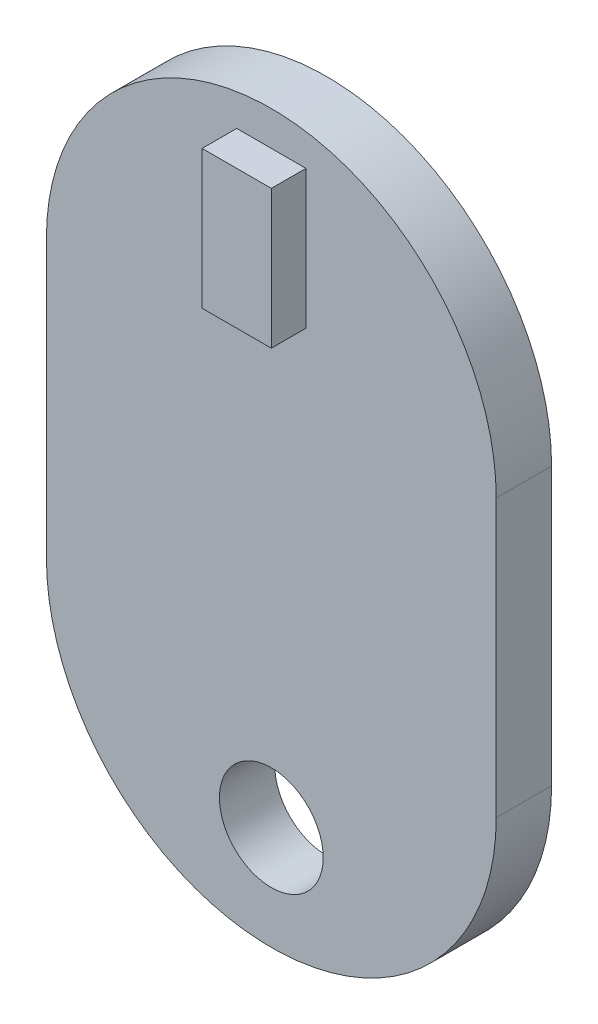
ISO-10303-21;
HEADER;
FILE_DESCRIPTION(('STEP AP214'),'2;1');
FILE_NAME('part.step','',(''),(''),'','','');
FILE_SCHEMA(('AUTOMOTIVE_DESIGN { 1 0 10303 214 1 1 1 1 }'));
ENDSEC;
DATA;
#1=APPLICATION_CONTEXT('core data for automotive mechanical design processes');
#2=APPLICATION_PROTOCOL_DEFINITION('international standard','automotive_design',2000,#1);
#3=PRODUCT_CONTEXT('',#1,'mechanical');
#4=PRODUCT('Part','Part','',(#3));
#5=PRODUCT_RELATED_PRODUCT_CATEGORY('part','',(#4));
#6=PRODUCT_DEFINITION_FORMATION('','',#4);
#7=PRODUCT_DEFINITION_CONTEXT('part definition',#1,'design');
#8=PRODUCT_DEFINITION('design','',#6,#7);
#9=PRODUCT_DEFINITION_SHAPE('','',#8);
#10=(LENGTH_UNIT() NAMED_UNIT(*) SI_UNIT(.MILLI.,.METRE.));
#11=(NAMED_UNIT(*) PLANE_ANGLE_UNIT() SI_UNIT($,.RADIAN.));
#12=(NAMED_UNIT(*) SI_UNIT($,.STERADIAN.) SOLID_ANGLE_UNIT());
#13=UNCERTAINTY_MEASURE_WITH_UNIT(LENGTH_MEASURE(1.E-05),#10,'distance_accuracy_value','');
#14=(GEOMETRIC_REPRESENTATION_CONTEXT(3) GLOBAL_UNCERTAINTY_ASSIGNED_CONTEXT((#13)) GLOBAL_UNIT_ASSIGNED_CONTEXT((#10,
#11,#12)) REPRESENTATION_CONTEXT('',''));
#15=CARTESIAN_POINT('',(0.,0.,0.));
#16=DIRECTION('',(0.,0.,1.));
#17=DIRECTION('',(1.,0.,0.));
#18=AXIS2_PLACEMENT_3D('',#15,#16,#17);
#19=CARTESIAN_POINT('',(0.,-3.5,1.6));
#20=DIRECTION('',(0.,0.,1.));
#21=DIRECTION('',(1.,0.,0.));
#22=AXIS2_PLACEMENT_3D('',#19,#20,#21);
#23=PLANE('',#22);
#24=CARTESIAN_POINT('',(0.,-3.5,1.6));
#25=DIRECTION('',(0.,0.,1.));
#26=DIRECTION('',(1.,0.,0.));
#27=AXIS2_PLACEMENT_3D('',#24,#25,#26);
#28=CIRCLE('',#27,6.5);
#29=CARTESIAN_POINT('',(6.5,-3.5,1.6));
#30=VERTEX_POINT('',#29);
#31=CARTESIAN_POINT('',(-6.5,-3.5,1.6));
#32=VERTEX_POINT('',#31);
#33=EDGE_CURVE('E143',#30,#32,#28,.T.);
#34=ORIENTED_EDGE('',*,*,#33,.T.);
#35=DIRECTION('',(0.,-1.,0.));
#36=VECTOR('',#35,1.);
#37=CARTESIAN_POINT('',(-6.5,-3.5,1.6));
#38=LINE('',#37,#36);
#39=CARTESIAN_POINT('',(-6.5,-11.5,1.6));
#40=VERTEX_POINT('',#39);
#41=EDGE_CURVE('E85',#32,#40,#38,.T.);
#42=ORIENTED_EDGE('',*,*,#41,.T.);
#43=CARTESIAN_POINT('',(0.,-11.5,1.6));
#44=DIRECTION('',(0.,0.,1.));
#45=DIRECTION('',(1.,0.,0.));
#46=AXIS2_PLACEMENT_3D('',#43,#44,#45);
#47=CIRCLE('',#46,6.5);
#48=CARTESIAN_POINT('',(6.5,-11.5,1.6));
#49=VERTEX_POINT('',#48);
#50=EDGE_CURVE('E146',#40,#49,#47,.T.);
#51=ORIENTED_EDGE('',*,*,#50,.T.);
#52=DIRECTION('',(0.,1.,0.));
#53=VECTOR('',#52,1.);
#54=CARTESIAN_POINT('',(6.5,-3.5,1.6));
#55=LINE('',#54,#53);
#56=EDGE_CURVE('E57',#49,#30,#55,.T.);
#57=ORIENTED_EDGE('',*,*,#56,.T.);
#58=EDGE_LOOP('',(#34,#42,#51,#57));
#59=FACE_BOUND('',#58,.T.);
#60=CARTESIAN_POINT('',(0.,-15.,1.6));
#61=DIRECTION('',(0.,0.,1.));
#62=DIRECTION('',(1.,0.,0.));
#63=AXIS2_PLACEMENT_3D('',#60,#61,#62);
#64=CIRCLE('',#63,1.5);
#65=CARTESIAN_POINT('',(1.5,-15.,1.6));
#66=VERTEX_POINT('',#65);
#67=EDGE_CURVE('E135',#66,#66,#64,.T.);
#68=ORIENTED_EDGE('',*,*,#67,.F.);
#69=EDGE_LOOP('',(#68));
#70=FACE_BOUND('',#69,.T.);
#71=DIRECTION('',(1.,0.,0.));
#72=VECTOR('',#71,1.);
#73=CARTESIAN_POINT('',(-0.999999999999999,-2.,1.6));
#74=LINE('',#73,#72);
#75=CARTESIAN_POINT('',(-0.999999999999999,-2.,1.6));
#76=VERTEX_POINT('',#75);
#77=CARTESIAN_POINT('',(1.,-2.,1.6));
#78=VERTEX_POINT('',#77);
#79=EDGE_CURVE('E281',#76,#78,#74,.T.);
#80=ORIENTED_EDGE('',*,*,#79,.F.);
#81=DIRECTION('',(0.,-1.,0.));
#82=VECTOR('',#81,1.);
#83=CARTESIAN_POINT('',(-1.,2.,1.6));
#84=LINE('',#83,#82);
#85=CARTESIAN_POINT('',(-1.,2.,1.6));
#86=VERTEX_POINT('',#85);
#87=EDGE_CURVE('E130',#86,#76,#84,.T.);
#88=ORIENTED_EDGE('',*,*,#87,.F.);
#89=DIRECTION('',(-1.,0.,0.));
#90=VECTOR('',#89,1.);
#91=CARTESIAN_POINT('',(-1.,2.,1.6));
#92=LINE('',#91,#90);
#93=CARTESIAN_POINT('',(1.,2.,1.6));
#94=VERTEX_POINT('',#93);
#95=EDGE_CURVE('E126',#94,#86,#92,.T.);
#96=ORIENTED_EDGE('',*,*,#95,.F.);
#97=DIRECTION('',(0.,1.,0.));
#98=VECTOR('',#97,1.);
#99=CARTESIAN_POINT('',(1.,2.,1.6));
#100=LINE('',#99,#98);
#101=EDGE_CURVE('E278',#78,#94,#100,.T.);
#102=ORIENTED_EDGE('',*,*,#101,.F.);
#103=EDGE_LOOP('',(#80,#88,#96,#102));
#104=FACE_BOUND('',#103,.T.);
#105=ADVANCED_FACE('F33',(#59,#70,#104),#23,.T.);
#106=CARTESIAN_POINT('',(0.,-3.5,0.));
#107=DIRECTION('',(0.,0.,1.));
#108=DIRECTION('',(1.,0.,0.));
#109=AXIS2_PLACEMENT_3D('',#106,#107,#108);
#110=PLANE('',#109);
#111=CARTESIAN_POINT('',(0.,-3.5,0.));
#112=DIRECTION('',(0.,0.,1.));
#113=DIRECTION('',(1.,0.,0.));
#114=AXIS2_PLACEMENT_3D('',#111,#112,#113);
#115=CIRCLE('',#114,6.5);
#116=CARTESIAN_POINT('',(6.5,-3.5,0.));
#117=VERTEX_POINT('',#116);
#118=CARTESIAN_POINT('',(-6.5,-3.5,0.));
#119=VERTEX_POINT('',#118);
#120=EDGE_CURVE('E141',#117,#119,#115,.T.);
#121=ORIENTED_EDGE('',*,*,#120,.F.);
#122=DIRECTION('',(0.,1.,0.));
#123=VECTOR('',#122,1.);
#124=CARTESIAN_POINT('',(6.5,-3.5,0.));
#125=LINE('',#124,#123);
#126=CARTESIAN_POINT('',(6.5,-11.5,0.));
#127=VERTEX_POINT('',#126);
#128=EDGE_CURVE('E78',#127,#117,#125,.T.);
#129=ORIENTED_EDGE('',*,*,#128,.F.);
#130=CARTESIAN_POINT('',(0.,-11.5,0.));
#131=DIRECTION('',(0.,0.,1.));
#132=DIRECTION('',(1.,0.,0.));
#133=AXIS2_PLACEMENT_3D('',#130,#131,#132);
#134=CIRCLE('',#133,6.5);
#135=CARTESIAN_POINT('',(-6.5,-11.5,0.));
#136=VERTEX_POINT('',#135);
#137=EDGE_CURVE('E154',#136,#127,#134,.T.);
#138=ORIENTED_EDGE('',*,*,#137,.F.);
#139=DIRECTION('',(0.,-1.,0.));
#140=VECTOR('',#139,1.);
#141=CARTESIAN_POINT('',(-6.5,-3.5,0.));
#142=LINE('',#141,#140);
#143=EDGE_CURVE('E152',#119,#136,#142,.T.);
#144=ORIENTED_EDGE('',*,*,#143,.F.);
#145=EDGE_LOOP('',(#121,#129,#138,#144));
#146=FACE_BOUND('',#145,.T.);
#147=CARTESIAN_POINT('',(0.,-15.,0.));
#148=DIRECTION('',(0.,0.,1.));
#149=DIRECTION('',(1.,0.,0.));
#150=AXIS2_PLACEMENT_3D('',#147,#148,#149);
#151=CIRCLE('',#150,1.5);
#152=CARTESIAN_POINT('',(1.5,-15.,0.));
#153=VERTEX_POINT('',#152);
#154=EDGE_CURVE('E132',#153,#153,#151,.T.);
#155=ORIENTED_EDGE('',*,*,#154,.T.);
#156=EDGE_LOOP('',(#155));
#157=FACE_BOUND('',#156,.T.);
#158=ADVANCED_FACE('F167',(#146,#157),#110,.F.);
#159=CARTESIAN_POINT('',(0.,-3.5,1.6));
#160=DIRECTION('',(0.,0.,-1.));
#161=DIRECTION('',(-1.,0.,0.));
#162=AXIS2_PLACEMENT_3D('',#159,#160,#161);
#163=CYLINDRICAL_SURFACE('',#162,6.5);
#164=ORIENTED_EDGE('',*,*,#120,.T.);
#165=DIRECTION('',(0.,0.,-1.));
#166=VECTOR('',#165,1.);
#167=CARTESIAN_POINT('',(-6.5,-3.5,1.6));
#168=LINE('',#167,#166);
#169=EDGE_CURVE('E11',#32,#119,#168,.T.);
#170=ORIENTED_EDGE('',*,*,#169,.F.);
#171=ORIENTED_EDGE('',*,*,#33,.F.);
#172=DIRECTION('',(0.,0.,-1.));
#173=VECTOR('',#172,1.);
#174=CARTESIAN_POINT('',(6.5,-3.5,1.6));
#175=LINE('',#174,#173);
#176=EDGE_CURVE('E149',#30,#117,#175,.T.);
#177=ORIENTED_EDGE('',*,*,#176,.T.);
#178=EDGE_LOOP('',(#164,#170,#171,#177));
#179=FACE_BOUND('',#178,.T.);
#180=ADVANCED_FACE('F35',(#179),#163,.T.);
#181=CARTESIAN_POINT('',(-6.5,-3.5,1.6));
#182=DIRECTION('',(1.,0.,0.));
#183=DIRECTION('',(0.,1.,0.));
#184=AXIS2_PLACEMENT_3D('',#181,#182,#183);
#185=PLANE('',#184);
#186=ORIENTED_EDGE('',*,*,#143,.T.);
#187=DIRECTION('',(0.,0.,-1.));
#188=VECTOR('',#187,1.);
#189=CARTESIAN_POINT('',(-6.5,-11.5,1.6));
#190=LINE('',#189,#188);
#191=EDGE_CURVE('E41',#40,#136,#190,.T.);
#192=ORIENTED_EDGE('',*,*,#191,.F.);
#193=ORIENTED_EDGE('',*,*,#41,.F.);
#194=ORIENTED_EDGE('',*,*,#169,.T.);
#195=EDGE_LOOP('',(#186,#192,#193,#194));
#196=FACE_BOUND('',#195,.T.);
#197=ADVANCED_FACE('F182',(#196),#185,.F.);
#198=CARTESIAN_POINT('',(0.,-11.5,1.6));
#199=DIRECTION('',(0.,0.,-1.));
#200=DIRECTION('',(-1.,0.,0.));
#201=AXIS2_PLACEMENT_3D('',#198,#199,#200);
#202=CYLINDRICAL_SURFACE('',#201,6.5);
#203=ORIENTED_EDGE('',*,*,#137,.T.);
#204=DIRECTION('',(0.,0.,-1.));
#205=VECTOR('',#204,1.);
#206=CARTESIAN_POINT('',(6.5,-11.5,1.6));
#207=LINE('',#206,#205);
#208=EDGE_CURVE('E158',#49,#127,#207,.T.);
#209=ORIENTED_EDGE('',*,*,#208,.F.);
#210=ORIENTED_EDGE('',*,*,#50,.F.);
#211=ORIENTED_EDGE('',*,*,#191,.T.);
#212=EDGE_LOOP('',(#203,#209,#210,#211));
#213=FACE_BOUND('',#212,.T.);
#214=ADVANCED_FACE('F163',(#213),#202,.T.);
#215=CARTESIAN_POINT('',(6.5,-3.5,1.6));
#216=DIRECTION('',(-1.,0.,0.));
#217=DIRECTION('',(0.,-1.,0.));
#218=AXIS2_PLACEMENT_3D('',#215,#216,#217);
#219=PLANE('',#218);
#220=ORIENTED_EDGE('',*,*,#128,.T.);
#221=ORIENTED_EDGE('',*,*,#176,.F.);
#222=ORIENTED_EDGE('',*,*,#56,.F.);
#223=ORIENTED_EDGE('',*,*,#208,.T.);
#224=EDGE_LOOP('',(#220,#221,#222,#223));
#225=FACE_BOUND('',#224,.T.);
#226=ADVANCED_FACE('F172',(#225),#219,.F.);
#227=CARTESIAN_POINT('',(0.,-15.,1.6));
#228=DIRECTION('',(0.,0.,-1.));
#229=DIRECTION('',(-1.,0.,0.));
#230=AXIS2_PLACEMENT_3D('',#227,#228,#229);
#231=CYLINDRICAL_SURFACE('',#230,1.5);
#232=ORIENTED_EDGE('',*,*,#67,.T.);
#233=EDGE_LOOP('',(#232));
#234=FACE_BOUND('',#233,.T.);
#235=ORIENTED_EDGE('',*,*,#154,.F.);
#236=EDGE_LOOP('',(#235));
#237=FACE_BOUND('',#236,.T.);
#238=ADVANCED_FACE('F174',(#234,#237),#231,.F.);
#239=CARTESIAN_POINT('',(-1.,2.,2.6));
#240=DIRECTION('',(1.,0.,0.));
#241=DIRECTION('',(0.,1.,0.));
#242=AXIS2_PLACEMENT_3D('',#239,#240,#241);
#243=PLANE('',#242);
#244=ORIENTED_EDGE('',*,*,#87,.T.);
#245=DIRECTION('',(0.,0.,-1.));
#246=VECTOR('',#245,1.);
#247=CARTESIAN_POINT('',(-0.999999999999999,-2.,2.6));
#248=LINE('',#247,#246);
#249=CARTESIAN_POINT('',(-0.999999999999999,-2.,2.6));
#250=VERTEX_POINT('',#249);
#251=EDGE_CURVE('E111',#250,#76,#248,.T.);
#252=ORIENTED_EDGE('',*,*,#251,.F.);
#253=DIRECTION('',(0.,-1.,0.));
#254=VECTOR('',#253,1.);
#255=CARTESIAN_POINT('',(-1.,2.,2.6));
#256=LINE('',#255,#254);
#257=CARTESIAN_POINT('',(-1.,2.,2.6));
#258=VERTEX_POINT('',#257);
#259=EDGE_CURVE('E118',#258,#250,#256,.T.);
#260=ORIENTED_EDGE('',*,*,#259,.F.);
#261=DIRECTION('',(0.,0.,-1.));
#262=VECTOR('',#261,1.);
#263=CARTESIAN_POINT('',(-1.,2.,2.6));
#264=LINE('',#263,#262);
#265=EDGE_CURVE('E275',#258,#86,#264,.T.);
#266=ORIENTED_EDGE('',*,*,#265,.T.);
#267=EDGE_LOOP('',(#244,#252,#260,#266));
#268=FACE_BOUND('',#267,.T.);
#269=ADVANCED_FACE('F128',(#268),#243,.F.);
#270=CARTESIAN_POINT('',(-0.999999999999999,-2.,2.6));
#271=DIRECTION('',(0.,1.,0.));
#272=DIRECTION('',(0.,0.,1.));
#273=AXIS2_PLACEMENT_3D('',#270,#271,#272);
#274=PLANE('',#273);
#275=ORIENTED_EDGE('',*,*,#79,.T.);
#276=DIRECTION('',(0.,0.,-1.));
#277=VECTOR('',#276,1.);
#278=CARTESIAN_POINT('',(1.,-2.,2.6));
#279=LINE('',#278,#277);
#280=CARTESIAN_POINT('',(1.,-2.,2.6));
#281=VERTEX_POINT('',#280);
#282=EDGE_CURVE('E114',#281,#78,#279,.T.);
#283=ORIENTED_EDGE('',*,*,#282,.F.);
#284=DIRECTION('',(1.,0.,0.));
#285=VECTOR('',#284,1.);
#286=CARTESIAN_POINT('',(-0.999999999999999,-2.,2.6));
#287=LINE('',#286,#285);
#288=EDGE_CURVE('E107',#250,#281,#287,.T.);
#289=ORIENTED_EDGE('',*,*,#288,.F.);
#290=ORIENTED_EDGE('',*,*,#251,.T.);
#291=EDGE_LOOP('',(#275,#283,#289,#290));
#292=FACE_BOUND('',#291,.T.);
#293=ADVANCED_FACE('F109',(#292),#274,.F.);
#294=CARTESIAN_POINT('',(1.,2.,2.6));
#295=DIRECTION('',(-1.,0.,0.));
#296=DIRECTION('',(0.,-1.,0.));
#297=AXIS2_PLACEMENT_3D('',#294,#295,#296);
#298=PLANE('',#297);
#299=ORIENTED_EDGE('',*,*,#101,.T.);
#300=DIRECTION('',(0.,0.,-1.));
#301=VECTOR('',#300,1.);
#302=CARTESIAN_POINT('',(1.,2.,2.6));
#303=LINE('',#302,#301);
#304=CARTESIAN_POINT('',(1.,2.,2.6));
#305=VERTEX_POINT('',#304);
#306=EDGE_CURVE('E48',#305,#94,#303,.T.);
#307=ORIENTED_EDGE('',*,*,#306,.F.);
#308=DIRECTION('',(0.,1.,0.));
#309=VECTOR('',#308,1.);
#310=CARTESIAN_POINT('',(1.,2.,2.6));
#311=LINE('',#310,#309);
#312=EDGE_CURVE('E117',#281,#305,#311,.T.);
#313=ORIENTED_EDGE('',*,*,#312,.F.);
#314=ORIENTED_EDGE('',*,*,#282,.T.);
#315=EDGE_LOOP('',(#299,#307,#313,#314));
#316=FACE_BOUND('',#315,.T.);
#317=ADVANCED_FACE('F196',(#316),#298,.F.);
#318=CARTESIAN_POINT('',(-1.,2.,2.6));
#319=DIRECTION('',(0.,-1.,0.));
#320=DIRECTION('',(0.,0.,-1.));
#321=AXIS2_PLACEMENT_3D('',#318,#319,#320);
#322=PLANE('',#321);
#323=ORIENTED_EDGE('',*,*,#95,.T.);
#324=ORIENTED_EDGE('',*,*,#265,.F.);
#325=DIRECTION('',(-1.,0.,0.));
#326=VECTOR('',#325,1.);
#327=CARTESIAN_POINT('',(-1.,2.,2.6));
#328=LINE('',#327,#326);
#329=EDGE_CURVE('E122',#305,#258,#328,.T.);
#330=ORIENTED_EDGE('',*,*,#329,.F.);
#331=ORIENTED_EDGE('',*,*,#306,.T.);
#332=EDGE_LOOP('',(#323,#324,#330,#331));
#333=FACE_BOUND('',#332,.T.);
#334=ADVANCED_FACE('F199',(#333),#322,.F.);
#335=CARTESIAN_POINT('',(0.,0.,2.6));
#336=DIRECTION('',(0.,0.,1.));
#337=DIRECTION('',(1.,0.,0.));
#338=AXIS2_PLACEMENT_3D('',#335,#336,#337);
#339=PLANE('',#338);
#340=ORIENTED_EDGE('',*,*,#259,.T.);
#341=ORIENTED_EDGE('',*,*,#288,.T.);
#342=ORIENTED_EDGE('',*,*,#312,.T.);
#343=ORIENTED_EDGE('',*,*,#329,.T.);
#344=EDGE_LOOP('',(#340,#341,#342,#343));
#345=FACE_BOUND('',#344,.T.);
#346=ADVANCED_FACE('F121',(#345),#339,.T.);
#347=CLOSED_SHELL('',(#105,#158,#180,#197,#214,#226,#238,#269,#293,#317,#334,#346));
#348=MANIFOLD_SOLID_BREP('B2',#347);
#349=ADVANCED_BREP_SHAPE_REPRESENTATION('',(#18,#348),#14);
#350=SHAPE_DEFINITION_REPRESENTATION(#9,#349);
ENDSEC;
END-ISO-10303-21;
